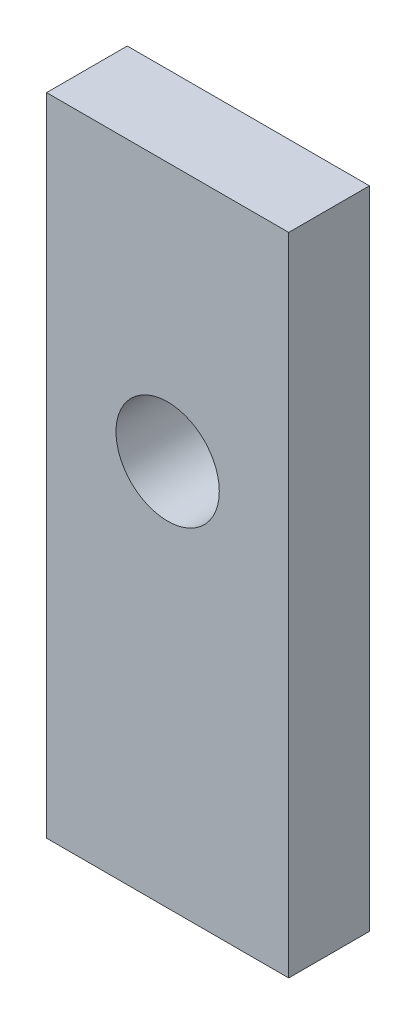
ISO-10303-21;
HEADER;
FILE_DESCRIPTION(('STEP AP214'),'2;1');
FILE_NAME('part.step','',(''),(''),'','','');
FILE_SCHEMA(('AUTOMOTIVE_DESIGN { 1 0 10303 214 1 1 1 1 }'));
ENDSEC;
DATA;
#1=APPLICATION_CONTEXT('core data for automotive mechanical design processes');
#2=APPLICATION_PROTOCOL_DEFINITION('international standard','automotive_design',2000,#1);
#3=PRODUCT_CONTEXT('',#1,'mechanical');
#4=PRODUCT('Part','Part','',(#3));
#5=PRODUCT_RELATED_PRODUCT_CATEGORY('part','',(#4));
#6=PRODUCT_DEFINITION_FORMATION('','',#4);
#7=PRODUCT_DEFINITION_CONTEXT('part definition',#1,'design');
#8=PRODUCT_DEFINITION('design','',#6,#7);
#9=PRODUCT_DEFINITION_SHAPE('','',#8);
#10=(LENGTH_UNIT() NAMED_UNIT(*) SI_UNIT(.MILLI.,.METRE.));
#11=(NAMED_UNIT(*) PLANE_ANGLE_UNIT() SI_UNIT($,.RADIAN.));
#12=(NAMED_UNIT(*) SI_UNIT($,.STERADIAN.) SOLID_ANGLE_UNIT());
#13=UNCERTAINTY_MEASURE_WITH_UNIT(LENGTH_MEASURE(1.E-05),#10,'distance_accuracy_value','');
#14=(GEOMETRIC_REPRESENTATION_CONTEXT(3) GLOBAL_UNCERTAINTY_ASSIGNED_CONTEXT((#13)) GLOBAL_UNIT_ASSIGNED_CONTEXT((#10,
#11,#12)) REPRESENTATION_CONTEXT('',''));
#15=CARTESIAN_POINT('',(0.,0.,0.));
#16=DIRECTION('',(0.,0.,1.));
#17=DIRECTION('',(1.,0.,0.));
#18=AXIS2_PLACEMENT_3D('',#15,#16,#17);
#19=CARTESIAN_POINT('',(0.,0.,2.5));
#20=DIRECTION('',(0.,0.,-1.));
#21=DIRECTION('',(-1.,0.,0.));
#22=AXIS2_PLACEMENT_3D('',#19,#20,#21);
#23=PLANE('',#22);
#24=DIRECTION('',(0.,1.,0.));
#25=VECTOR('',#24,1.);
#26=CARTESIAN_POINT('',(-7.5,-20.,2.5));
#27=LINE('',#26,#25);
#28=CARTESIAN_POINT('',(-7.5,-20.,2.5));
#29=VERTEX_POINT('',#28);
#30=CARTESIAN_POINT('',(-7.5,20.,2.5));
#31=VERTEX_POINT('',#30);
#32=EDGE_CURVE('E115',#29,#31,#27,.T.);
#33=ORIENTED_EDGE('',*,*,#32,.F.);
#34=DIRECTION('',(1.,0.,0.));
#35=VECTOR('',#34,1.);
#36=CARTESIAN_POINT('',(-7.5,-20.,2.5));
#37=LINE('',#36,#35);
#38=CARTESIAN_POINT('',(7.5,-20.,2.5));
#39=VERTEX_POINT('',#38);
#40=EDGE_CURVE('E105',#29,#39,#37,.T.);
#41=ORIENTED_EDGE('',*,*,#40,.T.);
#42=DIRECTION('',(0.,1.,0.));
#43=VECTOR('',#42,1.);
#44=CARTESIAN_POINT('',(7.5,-20.,2.5));
#45=LINE('',#44,#43);
#46=CARTESIAN_POINT('',(7.5,20.,2.5));
#47=VERTEX_POINT('',#46);
#48=EDGE_CURVE('E100',#39,#47,#45,.T.);
#49=ORIENTED_EDGE('',*,*,#48,.T.);
#50=DIRECTION('',(1.,0.,0.));
#51=VECTOR('',#50,1.);
#52=CARTESIAN_POINT('',(-7.5,20.,2.5));
#53=LINE('',#52,#51);
#54=EDGE_CURVE('E104',#31,#47,#53,.T.);
#55=ORIENTED_EDGE('',*,*,#54,.F.);
#56=EDGE_LOOP('',(#33,#41,#49,#55));
#57=FACE_BOUND('',#56,.T.);
#58=CARTESIAN_POINT('',(0.,3.9595,2.5));
#59=DIRECTION('',(0.,0.,1.));
#60=DIRECTION('',(1.,0.,0.));
#61=AXIS2_PLACEMENT_3D('',#58,#59,#60);
#62=CIRCLE('',#61,3.2);
#63=CARTESIAN_POINT('',(3.2,3.9595,2.5));
#64=VERTEX_POINT('',#63);
#65=EDGE_CURVE('E125',#64,#64,#62,.T.);
#66=ORIENTED_EDGE('',*,*,#65,.F.);
#67=EDGE_LOOP('',(#66));
#68=FACE_BOUND('',#67,.T.);
#69=ADVANCED_FACE('F54',(#57,#68),#23,.F.);
#70=CARTESIAN_POINT('',(0.,0.,-2.5));
#71=DIRECTION('',(0.,0.,-1.));
#72=DIRECTION('',(-1.,0.,0.));
#73=AXIS2_PLACEMENT_3D('',#70,#71,#72);
#74=PLANE('',#73);
#75=DIRECTION('',(0.,1.,0.));
#76=VECTOR('',#75,1.);
#77=CARTESIAN_POINT('',(-7.5,-20.,-2.5));
#78=LINE('',#77,#76);
#79=CARTESIAN_POINT('',(-7.5,-20.,-2.5));
#80=VERTEX_POINT('',#79);
#81=CARTESIAN_POINT('',(-7.5,20.,-2.5));
#82=VERTEX_POINT('',#81);
#83=EDGE_CURVE('E121',#80,#82,#78,.T.);
#84=ORIENTED_EDGE('',*,*,#83,.T.);
#85=DIRECTION('',(1.,0.,0.));
#86=VECTOR('',#85,1.);
#87=CARTESIAN_POINT('',(-7.5,20.,-2.5));
#88=LINE('',#87,#86);
#89=CARTESIAN_POINT('',(7.5,20.,-2.5));
#90=VERTEX_POINT('',#89);
#91=EDGE_CURVE('E124',#82,#90,#88,.T.);
#92=ORIENTED_EDGE('',*,*,#91,.T.);
#93=DIRECTION('',(0.,1.,0.));
#94=VECTOR('',#93,1.);
#95=CARTESIAN_POINT('',(7.5,-20.,-2.5));
#96=LINE('',#95,#94);
#97=CARTESIAN_POINT('',(7.5,-20.,-2.5));
#98=VERTEX_POINT('',#97);
#99=EDGE_CURVE('E112',#98,#90,#96,.T.);
#100=ORIENTED_EDGE('',*,*,#99,.F.);
#101=DIRECTION('',(1.,0.,0.));
#102=VECTOR('',#101,1.);
#103=CARTESIAN_POINT('',(-7.5,-20.,-2.5));
#104=LINE('',#103,#102);
#105=EDGE_CURVE('E88',#80,#98,#104,.T.);
#106=ORIENTED_EDGE('',*,*,#105,.F.);
#107=EDGE_LOOP('',(#84,#92,#100,#106));
#108=FACE_BOUND('',#107,.T.);
#109=CARTESIAN_POINT('',(0.,3.9595,-2.5));
#110=DIRECTION('',(0.,0.,1.));
#111=DIRECTION('',(1.,0.,0.));
#112=AXIS2_PLACEMENT_3D('',#109,#110,#111);
#113=CIRCLE('',#112,3.2);
#114=CARTESIAN_POINT('',(3.2,3.9595,-2.5));
#115=VERTEX_POINT('',#114);
#116=EDGE_CURVE('E160',#115,#115,#113,.T.);
#117=ORIENTED_EDGE('',*,*,#116,.T.);
#118=EDGE_LOOP('',(#117));
#119=FACE_BOUND('',#118,.T.);
#120=ADVANCED_FACE('F130',(#108,#119),#74,.T.);
#121=CARTESIAN_POINT('',(-7.5,-20.,2.5));
#122=DIRECTION('',(-1.,0.,0.));
#123=DIRECTION('',(0.,0.,1.));
#124=AXIS2_PLACEMENT_3D('',#121,#122,#123);
#125=PLANE('',#124);
#126=ORIENTED_EDGE('',*,*,#83,.F.);
#127=DIRECTION('',(0.,0.,-1.));
#128=VECTOR('',#127,1.);
#129=CARTESIAN_POINT('',(-7.5,-20.,2.5));
#130=LINE('',#129,#128);
#131=EDGE_CURVE('E12',#29,#80,#130,.T.);
#132=ORIENTED_EDGE('',*,*,#131,.F.);
#133=ORIENTED_EDGE('',*,*,#32,.T.);
#134=DIRECTION('',(0.,0.,-1.));
#135=VECTOR('',#134,1.);
#136=CARTESIAN_POINT('',(-7.5,20.,2.5));
#137=LINE('',#136,#135);
#138=EDGE_CURVE('E58',#31,#82,#137,.T.);
#139=ORIENTED_EDGE('',*,*,#138,.T.);
#140=EDGE_LOOP('',(#126,#132,#133,#139));
#141=FACE_BOUND('',#140,.T.);
#142=ADVANCED_FACE('F56',(#141),#125,.T.);
#143=CARTESIAN_POINT('',(-7.5,-20.,2.5));
#144=DIRECTION('',(0.,1.,0.));
#145=DIRECTION('',(0.,0.,1.));
#146=AXIS2_PLACEMENT_3D('',#143,#144,#145);
#147=PLANE('',#146);
#148=ORIENTED_EDGE('',*,*,#105,.T.);
#149=DIRECTION('',(0.,0.,-1.));
#150=VECTOR('',#149,1.);
#151=CARTESIAN_POINT('',(7.5,-20.,2.5));
#152=LINE('',#151,#150);
#153=EDGE_CURVE('E64',#39,#98,#152,.T.);
#154=ORIENTED_EDGE('',*,*,#153,.F.);
#155=ORIENTED_EDGE('',*,*,#40,.F.);
#156=ORIENTED_EDGE('',*,*,#131,.T.);
#157=EDGE_LOOP('',(#148,#154,#155,#156));
#158=FACE_BOUND('',#157,.T.);
#159=ADVANCED_FACE('F133',(#158),#147,.F.);
#160=CARTESIAN_POINT('',(7.5,-20.,2.5));
#161=DIRECTION('',(-1.,0.,0.));
#162=DIRECTION('',(0.,0.,1.));
#163=AXIS2_PLACEMENT_3D('',#160,#161,#162);
#164=PLANE('',#163);
#165=ORIENTED_EDGE('',*,*,#99,.T.);
#166=DIRECTION('',(0.,0.,-1.));
#167=VECTOR('',#166,1.);
#168=CARTESIAN_POINT('',(7.5,20.,2.5));
#169=LINE('',#168,#167);
#170=EDGE_CURVE('E109',#47,#90,#169,.T.);
#171=ORIENTED_EDGE('',*,*,#170,.F.);
#172=ORIENTED_EDGE('',*,*,#48,.F.);
#173=ORIENTED_EDGE('',*,*,#153,.T.);
#174=EDGE_LOOP('',(#165,#171,#172,#173));
#175=FACE_BOUND('',#174,.T.);
#176=ADVANCED_FACE('F110',(#175),#164,.F.);
#177=CARTESIAN_POINT('',(-7.5,20.,2.5));
#178=DIRECTION('',(0.,1.,0.));
#179=DIRECTION('',(0.,0.,1.));
#180=AXIS2_PLACEMENT_3D('',#177,#178,#179);
#181=PLANE('',#180);
#182=ORIENTED_EDGE('',*,*,#91,.F.);
#183=ORIENTED_EDGE('',*,*,#138,.F.);
#184=ORIENTED_EDGE('',*,*,#54,.T.);
#185=ORIENTED_EDGE('',*,*,#170,.T.);
#186=EDGE_LOOP('',(#182,#183,#184,#185));
#187=FACE_BOUND('',#186,.T.);
#188=ADVANCED_FACE('F114',(#187),#181,.T.);
#189=CARTESIAN_POINT('',(0.,3.9595,2.5));
#190=DIRECTION('',(0.,0.,-1.));
#191=DIRECTION('',(-1.,0.,0.));
#192=AXIS2_PLACEMENT_3D('',#189,#190,#191);
#193=CYLINDRICAL_SURFACE('',#192,3.2);
#194=ORIENTED_EDGE('',*,*,#65,.T.);
#195=EDGE_LOOP('',(#194));
#196=FACE_BOUND('',#195,.T.);
#197=ORIENTED_EDGE('',*,*,#116,.F.);
#198=EDGE_LOOP('',(#197));
#199=FACE_BOUND('',#198,.T.);
#200=ADVANCED_FACE('F145',(#196,#199),#193,.F.);
#201=CLOSED_SHELL('',(#69,#120,#142,#159,#176,#188,#200));
#202=MANIFOLD_SOLID_BREP('B2',#201);
#203=ADVANCED_BREP_SHAPE_REPRESENTATION('',(#18,#202),#14);
#204=SHAPE_DEFINITION_REPRESENTATION(#9,#203);
ENDSEC;
END-ISO-10303-21;
